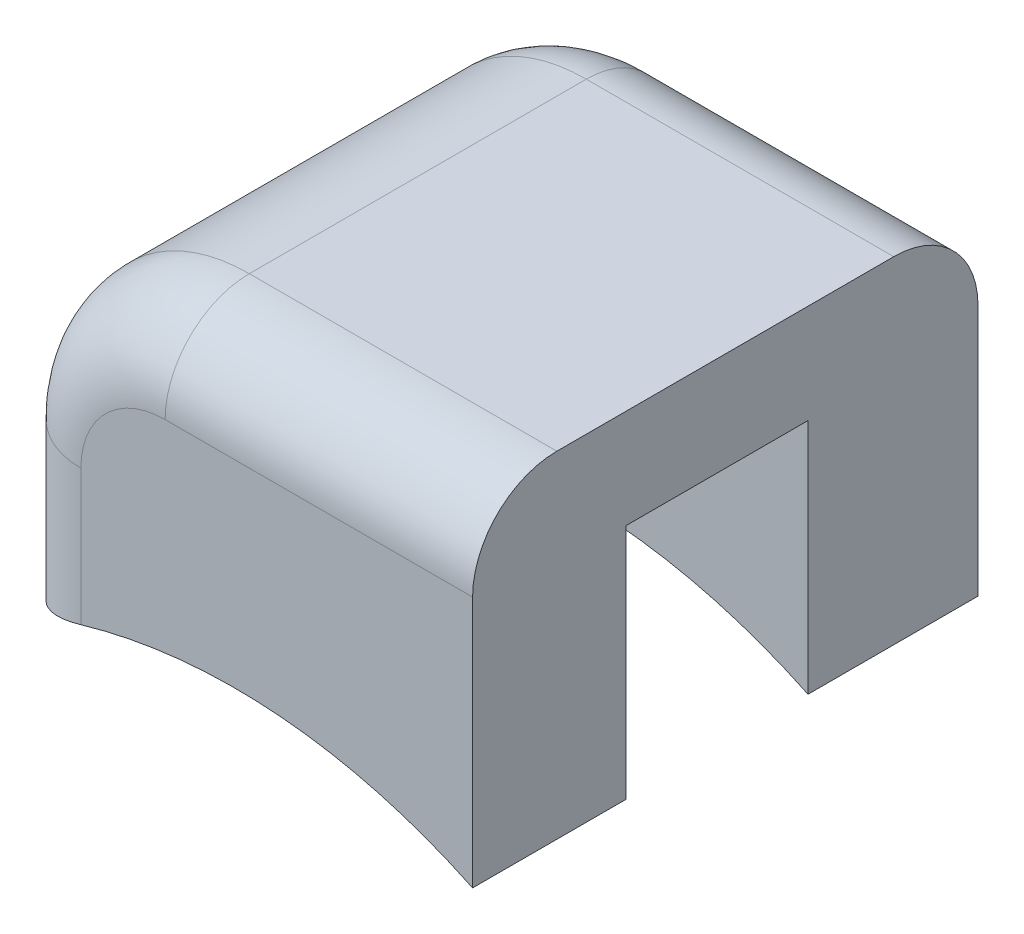
ISO-10303-21;
HEADER;
FILE_DESCRIPTION(('STEP AP214'),'2;1');
FILE_NAME('part.step','',(''),(''),'','','');
FILE_SCHEMA(('AUTOMOTIVE_DESIGN { 1 0 10303 214 1 1 1 1 }'));
ENDSEC;
DATA;
#1=APPLICATION_CONTEXT('core data for automotive mechanical design processes');
#2=APPLICATION_PROTOCOL_DEFINITION('international standard','automotive_design',2000,#1);
#3=PRODUCT_CONTEXT('',#1,'mechanical');
#4=PRODUCT('Part','Part','',(#3));
#5=PRODUCT_RELATED_PRODUCT_CATEGORY('part','',(#4));
#6=PRODUCT_DEFINITION_FORMATION('','',#4);
#7=PRODUCT_DEFINITION_CONTEXT('part definition',#1,'design');
#8=PRODUCT_DEFINITION('design','',#6,#7);
#9=PRODUCT_DEFINITION_SHAPE('','',#8);
#10=(LENGTH_UNIT() NAMED_UNIT(*) SI_UNIT(.MILLI.,.METRE.));
#11=(NAMED_UNIT(*) PLANE_ANGLE_UNIT() SI_UNIT($,.RADIAN.));
#12=(NAMED_UNIT(*) SI_UNIT($,.STERADIAN.) SOLID_ANGLE_UNIT());
#13=UNCERTAINTY_MEASURE_WITH_UNIT(LENGTH_MEASURE(1.E-05),#10,'distance_accuracy_value','');
#14=(GEOMETRIC_REPRESENTATION_CONTEXT(3) GLOBAL_UNCERTAINTY_ASSIGNED_CONTEXT((#13)) GLOBAL_UNIT_ASSIGNED_CONTEXT((#10,
#11,#12)) REPRESENTATION_CONTEXT('',''));
#15=CARTESIAN_POINT('',(0.,0.,0.));
#16=DIRECTION('',(0.,0.,1.));
#17=DIRECTION('',(1.,0.,0.));
#18=AXIS2_PLACEMENT_3D('',#15,#16,#17);
#19=CARTESIAN_POINT('',(-1.60474776372662,7.45402114965413,11.7834586810687));
#20=DIRECTION('',(0.,0.,-1.));
#21=DIRECTION('',(-0.266482277752373,-0.963839818457355,0.));
#22=AXIS2_PLACEMENT_3D('',#19,#20,#21);
#23=CYLINDRICAL_SURFACE('',#22,5.4);
#24=CARTESIAN_POINT('',(-1.60474776372662,7.45402114965413,11.7834586810687));
#25=DIRECTION('',(0.,0.,1.));
#26=DIRECTION('',(-0.266482277752373,-0.963839818457355,0.));
#27=AXIS2_PLACEMENT_3D('',#24,#25,#26);
#28=CIRCLE('',#27,5.4);
#29=CARTESIAN_POINT('',(-6.80948278339634,8.89302544951694,11.7834586810687));
#30=VERTEX_POINT('',#29);
#31=CARTESIAN_POINT('',(-7.00474776372663,7.45402114965413,11.7834586810687));
#32=VERTEX_POINT('',#31);
#33=EDGE_CURVE('E199',#30,#32,#28,.T.);
#34=ORIENTED_EDGE('',*,*,#33,.T.);
#35=DIRECTION('',(0.,0.,-1.));
#36=VECTOR('',#35,1.);
#37=CARTESIAN_POINT('',(-7.00474776372662,7.45402114965413,11.7834586810687));
#38=LINE('',#37,#36);
#39=CARTESIAN_POINT('',(-7.00474776372662,7.45402114965413,-9.81654131893127));
#40=VERTEX_POINT('',#39);
#41=EDGE_CURVE('E185',#40,#32,#38,.F.);
#42=ORIENTED_EDGE('',*,*,#41,.F.);
#43=CARTESIAN_POINT('',(-1.60474776372662,7.45402114965413,-9.81654131893128));
#44=DIRECTION('',(0.,0.,1.));
#45=DIRECTION('',(-0.266482277752373,-0.963839818457355,0.));
#46=AXIS2_PLACEMENT_3D('',#43,#44,#45);
#47=CIRCLE('',#46,5.4);
#48=CARTESIAN_POINT('',(-6.80948278339634,8.89302544951694,-9.81654131893128));
#49=VERTEX_POINT('',#48);
#50=EDGE_CURVE('E197',#49,#40,#47,.T.);
#51=ORIENTED_EDGE('',*,*,#50,.F.);
#52=DIRECTION('',(0.,0.,-1.));
#53=VECTOR('',#52,1.);
#54=CARTESIAN_POINT('',(-6.80948278339634,8.89302544951694,11.7834586810687));
#55=LINE('',#54,#53);
#56=EDGE_CURVE('E232',#30,#49,#55,.T.);
#57=ORIENTED_EDGE('',*,*,#56,.F.);
#58=EDGE_LOOP('',(#34,#42,#51,#57));
#59=FACE_BOUND('',#58,.T.);
#60=ADVANCED_FACE('F35',(#59),#23,.F.);
#61=CARTESIAN_POINT('',(8.21191709884672,-58.4631871224728,-30.));
#62=DIRECTION('',(0.,0.,1.));
#63=DIRECTION('',(1.,0.,0.));
#64=AXIS2_PLACEMENT_3D('',#61,#62,#63);
#65=CYLINDRICAL_SURFACE('',#64,65.);
#66=CARTESIAN_POINT('',(8.21191709884672,-58.4631871224728,-9.81654131893128));
#67=DIRECTION('',(0.,0.,-1.));
#68=DIRECTION('',(-1.,0.,0.));
#69=AXIS2_PLACEMENT_3D('',#66,#67,#68);
#70=CIRCLE('',#69,65.);
#71=CARTESIAN_POINT('',(36.4183536633174,0.097865944685166,-9.81654131893128));
#72=VERTEX_POINT('',#71);
#73=CARTESIAN_POINT('',(-7.00474776372662,4.73058717895761,-9.81654131893127));
#74=VERTEX_POINT('',#73);
#75=EDGE_CURVE('E247',#72,#74,#70,.F.);
#76=ORIENTED_EDGE('',*,*,#75,.T.);
#77=DIRECTION('',(0.,0.,1.));
#78=VECTOR('',#77,1.);
#79=CARTESIAN_POINT('',(-7.00474776372662,4.73058717895761,-30.));
#80=LINE('',#79,#78);
#81=CARTESIAN_POINT('',(-7.00474776372663,4.73058717895761,11.7834586810687));
#82=VERTEX_POINT('',#81);
#83=EDGE_CURVE('E188',#74,#82,#80,.T.);
#84=ORIENTED_EDGE('',*,*,#83,.T.);
#85=CARTESIAN_POINT('',(8.21191709884672,-58.4631871224728,11.7834586810687));
#86=DIRECTION('',(0.,0.,-1.));
#87=DIRECTION('',(-1.,0.,0.));
#88=AXIS2_PLACEMENT_3D('',#85,#86,#87);
#89=CIRCLE('',#88,65.);
#90=CARTESIAN_POINT('',(36.4183536633174,0.097865944685166,11.7834586810687));
#91=VERTEX_POINT('',#90);
#92=EDGE_CURVE('E251',#91,#82,#89,.F.);
#93=ORIENTED_EDGE('',*,*,#92,.F.);
#94=DIRECTION('',(0.,0.,1.));
#95=VECTOR('',#94,1.);
#96=CARTESIAN_POINT('',(36.4183536633174,0.097865944685166,-30.));
#97=LINE('',#96,#95);
#98=CARTESIAN_POINT('',(36.4183536633174,0.097865944685166,30.));
#99=VERTEX_POINT('',#98);
#100=EDGE_CURVE('E367',#91,#99,#97,.T.);
#101=ORIENTED_EDGE('',*,*,#100,.T.);
#102=CARTESIAN_POINT('',(8.21191709884672,-58.4631871224728,30.));
#103=DIRECTION('',(0.,0.,1.));
#104=DIRECTION('',(1.,0.,0.));
#105=AXIS2_PLACEMENT_3D('',#102,#103,#104);
#106=CIRCLE('',#105,65.);
#107=CARTESIAN_POINT('',(-10.0816463366826,3.90944739644315,30.));
#108=VERTEX_POINT('',#107);
#109=EDGE_CURVE('E243',#99,#108,#106,.T.);
#110=ORIENTED_EDGE('',*,*,#109,.T.);
#111=CARTESIAN_POINT('',(-10.0816463366826,3.90944739644316,30.));
#112=CARTESIAN_POINT('',(-10.378282537741,3.8224684695195,30.0000233975222));
#113=CARTESIAN_POINT('',(-10.6742547183916,3.73334122083876,29.9868027861182));
#114=CARTESIAN_POINT('',(-11.2627383926234,3.55158405455507,29.9343916264971));
#115=CARTESIAN_POINT('',(-11.5552506288941,3.45895490724183,29.8952067584868));
#116=CARTESIAN_POINT('',(-12.1345430642822,3.27103686715756,29.791433141585));
#117=CARTESIAN_POINT('',(-12.4213283548683,3.17575053552765,29.7268681193237));
#118=CARTESIAN_POINT('',(-12.9875438942233,2.98331169083991,29.5729737172092));
#119=CARTESIAN_POINT('',(-13.2669738209991,2.88615909640436,29.4836432551759));
#120=CARTESIAN_POINT('',(-13.81649185411,2.69099663953492,29.2809831904679));
#121=CARTESIAN_POINT('',(-14.0865848189868,2.59298725724344,29.1676662947932));
#122=CARTESIAN_POINT('',(-14.6159273850831,2.39705601588183,28.917734718645));
#123=CARTESIAN_POINT('',(-14.8751732222048,2.29913419854609,28.7811120328925));
#124=CARTESIAN_POINT('',(-15.3810418272217,2.10450846200494,28.4854139034765));
#125=CARTESIAN_POINT('',(-15.6276636525323,2.00780463414721,28.3263367865527));
#126=CARTESIAN_POINT('',(-16.1065919144859,1.81679788803389,27.9866279260235));
#127=CARTESIAN_POINT('',(-16.3388980791381,1.72249501541529,27.8059957730738));
#128=CARTESIAN_POINT('',(-16.789538169934,1.53670599086733,27.4224335299424));
#129=CARTESIAN_POINT('',(-17.0077274699484,1.44525284267398,27.2193173274404));
#130=CARTESIAN_POINT('',(-17.4260061521055,1.2674459423152,26.7933382077045));
#131=CARTESIAN_POINT('',(-17.6261025290174,1.18109022399221,26.5704829881558));
#132=CARTESIAN_POINT('',(-18.0065759297337,1.01482349623298,26.1061925786252));
#133=CARTESIAN_POINT('',(-18.1869487983716,0.934913845721202,25.8647534917506));
#134=CARTESIAN_POINT('',(-18.5261457692484,0.782998756154122,25.36485279095));
#135=CARTESIAN_POINT('',(-18.6849719369585,0.710992559598596,25.1063928121837));
#136=CARTESIAN_POINT('',(-18.9714197945042,0.57992988862597,24.5885415617894));
#137=CARTESIAN_POINT('',(-19.1002604686438,0.520385175025827,24.3299482792993));
#138=CARTESIAN_POINT('',(-19.3356721176254,0.410807110309911,23.8008961183374));
#139=CARTESIAN_POINT('',(-19.442246025665,0.360772506507275,23.5304388083988));
#140=CARTESIAN_POINT('',(-19.6316870307287,0.27134009555267,22.9801433895772));
#141=CARTESIAN_POINT('',(-19.7145932871243,0.231924724473483,22.7003216419988));
#142=CARTESIAN_POINT('',(-19.8558082937957,0.164527282034828,22.1333233466229));
#143=CARTESIAN_POINT('',(-19.9141298968374,0.136539236752666,21.8461507253409));
#144=CARTESIAN_POINT('',(-20.0002544374456,0.0951214082642211,21.2995574965327));
#145=CARTESIAN_POINT('',(-20.030755815797,0.0804065134463926,21.0406561609311));
#146=CARTESIAN_POINT('',(-20.0714603127351,0.0607452059903598,20.5211796437377));
#147=CARTESIAN_POINT('',(-20.0816853503566,0.055788244918784,20.2606065754688));
#148=CARTESIAN_POINT('',(-20.0816463366826,0.0558206281690486,20.));
#149=B_SPLINE_CURVE_WITH_KNOTS('',3,(#111,#112,#113,#114,#115,#116,#117,#118,#119,#120,#121,
#122,#123,#124,#125,#126,#127,#128,#129,#130,#131,#132,#133,#134,#135,#136,#137,#138,#139,#140,
#141,#142,#143,#144,#145,#146,#147,#148),.UNSPECIFIED.,.F.,.F.,(4,2,2,2,2,2,2,2,2,2,2,2,2,2,2,2,
2,2,4),(0.,0.927037950259322,1.85387315912949,2.77984396910066,3.70585524777369,
4.63137718701947,5.55721767523249,6.48312719172861,7.40905429465396,8.34331776001279,
9.27721847853309,10.2113155651059,11.1453230455694,12.0290877912175,12.9127360451638,
13.7949136688827,14.6766295196854,15.4589888449611,16.240501965779),.UNSPECIFIED.);
#150=CARTESIAN_POINT('',(-20.0816463366826,0.0558206281690427,20.));
#151=VERTEX_POINT('',#150);
#152=EDGE_CURVE('E281',#108,#151,#149,.T.);
#153=ORIENTED_EDGE('',*,*,#152,.T.);
#154=DIRECTION('',(0.,0.,1.));
#155=VECTOR('',#154,1.);
#156=CARTESIAN_POINT('',(-20.0816463366826,0.0558206281690427,-30.));
#157=LINE('',#156,#155);
#158=CARTESIAN_POINT('',(-20.0816463366826,0.0558206281690427,-20.));
#159=VERTEX_POINT('',#158);
#160=EDGE_CURVE('E364',#159,#151,#157,.T.);
#161=ORIENTED_EDGE('',*,*,#160,.F.);
#162=CARTESIAN_POINT('',(-20.0816463366826,0.0558206281690427,-20.));
#163=CARTESIAN_POINT('',(-20.0816898256157,0.055785374073303,-20.2632468680299));
#164=CARTESIAN_POINT('',(-20.0712535056147,0.0608451080586035,-20.5264748146823));
#165=CARTESIAN_POINT('',(-20.0297445247417,0.080894759068991,-21.0508346852526));
#166=CARTESIAN_POINT('',(-19.9986785753231,0.0958814465466083,-21.3119672629045));
#167=CARTESIAN_POINT('',(-19.9163933258543,0.135448539200208,-21.8292455362598));
#168=CARTESIAN_POINT('',(-19.8652527650541,0.159991458679941,-22.0854066609821));
#169=CARTESIAN_POINT('',(-19.743401678732,0.21819608625328,-22.591975685664));
#170=CARTESIAN_POINT('',(-19.6726902747543,0.251858203669251,-22.8423833268265));
#171=CARTESIAN_POINT('',(-19.5125329800728,0.327651358506734,-23.3354930895065));
#172=CARTESIAN_POINT('',(-19.4231077607029,0.369773049407864,-23.5782033757079));
#173=CARTESIAN_POINT('',(-19.226319085666,0.461807502674222,-24.0548067349629));
#174=CARTESIAN_POINT('',(-19.1189489022543,0.511723186621366,-24.2886964606416));
#175=CARTESIAN_POINT('',(-18.8872234005916,0.618560120416469,-24.7463268673653));
#176=CARTESIAN_POINT('',(-18.7628623768784,0.675483722860102,-24.9700641054798));
#177=CARTESIAN_POINT('',(-18.4981566171431,0.795509138838417,-25.4062432665296));
#178=CARTESIAN_POINT('',(-18.3578056637872,0.858613354221759,-25.6186807483833));
#179=CARTESIAN_POINT('',(-18.0549877018496,0.993338913319643,-26.041245511715));
#180=CARTESIAN_POINT('',(-17.8917757140655,1.06522560084971,-26.2507542767197));
#181=CARTESIAN_POINT('',(-17.5501064790644,1.21388435384116,-26.6552405437244));
#182=CARTESIAN_POINT('',(-17.3716426336388,1.29065853001038,-26.850211687509));
#183=CARTESIAN_POINT('',(-17.0007159096525,1.4481117033734,-27.2246754205517));
#184=CARTESIAN_POINT('',(-16.8082516207461,1.52879109368731,-27.4041664464165));
#185=CARTESIAN_POINT('',(-16.4105281044262,1.693121719101,-27.7468816308969));
#186=CARTESIAN_POINT('',(-16.205268096649,1.7767731353196,-27.9101047958151));
#187=CARTESIAN_POINT('',(-15.7644506347612,1.95365697073893,-28.2332789570941));
#188=CARTESIAN_POINT('',(-15.5278194589942,2.04708216918056,-28.3916622037097));
#189=CARTESIAN_POINT('',(-15.0424092858214,2.23528109337754,-28.6874385223039));
#190=CARTESIAN_POINT('',(-14.7936338419095,2.33005441897827,-28.8248376863571));
#191=CARTESIAN_POINT('',(-14.2853714917446,2.51997132632587,-29.0779572843017));
#192=CARTESIAN_POINT('',(-14.0258828856996,2.61511496464214,-29.1936742617568));
#193=CARTESIAN_POINT('',(-13.4979125242238,2.80476472531449,-29.4026425640901));
#194=CARTESIAN_POINT('',(-13.229434568863,2.89927109726144,-29.4959032486931));
#195=CARTESIAN_POINT('',(-12.7254599980836,3.07287036621806,-29.6472188130808));
#196=CARTESIAN_POINT('',(-12.4909805582677,3.15216961186091,-29.7084442396436));
#197=CARTESIAN_POINT('',(-12.017709157297,3.30917225014238,-29.8137873066604));
#198=CARTESIAN_POINT('',(-11.7789177682556,3.38687585161083,-29.8579071994887));
#199=CARTESIAN_POINT('',(-11.2981753947985,3.54019853407672,-29.9286985407761));
#200=CARTESIAN_POINT('',(-11.0562253392701,3.61581820842501,-29.9553750060639));
#201=CARTESIAN_POINT('',(-10.5702135165928,3.76459223964444,-29.9910332741437));
#202=CARTESIAN_POINT('',(-10.326151278723,3.83774602820823,-30.0000110249885));
#203=CARTESIAN_POINT('',(-10.0816463366826,3.90944739644315,-30.));
#204=B_SPLINE_CURVE_WITH_KNOTS('',3,(#162,#163,#164,#165,#166,#167,#168,#169,#170,#171,#172,
#173,#174,#175,#176,#177,#178,#179,#180,#181,#182,#183,#184,#185,#186,#187,#188,#189,#190,#191,
#192,#193,#194,#195,#196,#197,#198,#199,#200,#201,#202,#203),.UNSPECIFIED.,.F.,.F.,(4,2,2,2,2,2,
2,2,2,2,2,2,2,2,2,2,2,2,2,2,4),(0.,0.7894557995724,1.57865489062172,2.36478892618784,
3.15095825384602,3.9362637175971,4.72186426330649,5.50772926217347,6.29390087707607,
7.11843328532367,7.94332422347584,8.76829837303877,9.59332288404193,10.4913558613222,
11.389127625057,12.2870423843248,13.1845822447181,13.9489457457435,14.7132085648443,
15.4772514808254,16.2414692966394),.UNSPECIFIED.);
#205=CARTESIAN_POINT('',(-10.0816463366826,3.90944739644315,-30.));
#206=VERTEX_POINT('',#205);
#207=EDGE_CURVE('E273',#159,#206,#204,.T.);
#208=ORIENTED_EDGE('',*,*,#207,.T.);
#209=CARTESIAN_POINT('',(8.21191709884672,-58.4631871224728,-30.));
#210=DIRECTION('',(0.,0.,1.));
#211=DIRECTION('',(1.,0.,0.));
#212=AXIS2_PLACEMENT_3D('',#209,#210,#211);
#213=CIRCLE('',#212,65.);
#214=CARTESIAN_POINT('',(36.4183536633174,0.097865944685166,-30.));
#215=VERTEX_POINT('',#214);
#216=EDGE_CURVE('E244',#215,#206,#213,.T.);
#217=ORIENTED_EDGE('',*,*,#216,.F.);
#218=EDGE_CURVE('E399',#215,#72,#97,.T.);
#219=ORIENTED_EDGE('',*,*,#218,.T.);
#220=EDGE_LOOP('',(#76,#84,#93,#101,#110,#153,#161,#208,#217,#219));
#221=FACE_BOUND('',#220,.T.);
#222=ADVANCED_FACE('F291',(#221),#65,.F.);
#223=CARTESIAN_POINT('',(-22.5816463366826,40.,-30.));
#224=DIRECTION('',(0.,0.,1.));
#225=DIRECTION('',(1.,0.,0.));
#226=AXIS2_PLACEMENT_3D('',#223,#224,#225);
#227=PLANE('',#226);
#228=ORIENTED_EDGE('',*,*,#216,.T.);
#229=DIRECTION('',(0.,-1.,0.));
#230=VECTOR('',#229,1.);
#231=CARTESIAN_POINT('',(-10.0816463366826,20.,-30.));
#232=LINE('',#231,#230);
#233=CARTESIAN_POINT('',(-10.0816463366826,20.,-30.));
#234=VERTEX_POINT('',#233);
#235=EDGE_CURVE('E458',#206,#234,#232,.F.);
#236=ORIENTED_EDGE('',*,*,#235,.T.);
#237=CARTESIAN_POINT('',(-0.0816463366825846,20.,-30.));
#238=DIRECTION('',(0.,0.,1.));
#239=DIRECTION('',(1.,0.,0.));
#240=AXIS2_PLACEMENT_3D('',#237,#238,#239);
#241=CIRCLE('',#240,10.);
#242=CARTESIAN_POINT('',(-0.0816463366825846,30.,-30.));
#243=VERTEX_POINT('',#242);
#244=EDGE_CURVE('E472',#234,#243,#241,.F.);
#245=ORIENTED_EDGE('',*,*,#244,.T.);
#246=DIRECTION('',(-1.,0.,0.));
#247=VECTOR('',#246,1.);
#248=CARTESIAN_POINT('',(36.4183536633174,30.,-30.));
#249=LINE('',#248,#247);
#250=CARTESIAN_POINT('',(36.4183536633174,30.,-30.));
#251=VERTEX_POINT('',#250);
#252=EDGE_CURVE('E474',#243,#251,#249,.F.);
#253=ORIENTED_EDGE('',*,*,#252,.T.);
#254=DIRECTION('',(0.,1.,0.));
#255=VECTOR('',#254,1.);
#256=CARTESIAN_POINT('',(36.4183536633174,40.,-30.));
#257=LINE('',#256,#255);
#258=EDGE_CURVE('E408',#215,#251,#257,.T.);
#259=ORIENTED_EDGE('',*,*,#258,.F.);
#260=EDGE_LOOP('',(#228,#236,#245,#253,#259));
#261=FACE_BOUND('',#260,.T.);
#262=ADVANCED_FACE('F296',(#261),#227,.F.);
#263=CARTESIAN_POINT('',(-22.5816463366826,40.,30.));
#264=DIRECTION('',(0.,0.,-1.));
#265=DIRECTION('',(-1.,0.,0.));
#266=AXIS2_PLACEMENT_3D('',#263,#264,#265);
#267=PLANE('',#266);
#268=CARTESIAN_POINT('',(-0.08164633668258,20.,30.));
#269=DIRECTION('',(0.,0.,-1.));
#270=DIRECTION('',(-1.,0.,0.));
#271=AXIS2_PLACEMENT_3D('',#268,#269,#270);
#272=CIRCLE('',#271,10.);
#273=CARTESIAN_POINT('',(-0.08164633668258,30.,30.));
#274=VERTEX_POINT('',#273);
#275=CARTESIAN_POINT('',(-10.0816463366826,20.,30.));
#276=VERTEX_POINT('',#275);
#277=EDGE_CURVE('E269',#274,#276,#272,.F.);
#278=ORIENTED_EDGE('',*,*,#277,.T.);
#279=DIRECTION('',(0.,1.,0.));
#280=VECTOR('',#279,1.);
#281=CARTESIAN_POINT('',(-10.0816463366826,0.0558206281690427,30.));
#282=LINE('',#281,#280);
#283=EDGE_CURVE('E271',#276,#108,#282,.F.);
#284=ORIENTED_EDGE('',*,*,#283,.T.);
#285=ORIENTED_EDGE('',*,*,#109,.F.);
#286=DIRECTION('',(0.,-1.,0.));
#287=VECTOR('',#286,1.);
#288=CARTESIAN_POINT('',(36.4183536633174,40.,30.));
#289=LINE('',#288,#287);
#290=CARTESIAN_POINT('',(36.4183536633174,30.,30.));
#291=VERTEX_POINT('',#290);
#292=EDGE_CURVE('E404',#291,#99,#289,.T.);
#293=ORIENTED_EDGE('',*,*,#292,.F.);
#294=DIRECTION('',(1.,0.,0.));
#295=VECTOR('',#294,1.);
#296=CARTESIAN_POINT('',(-0.0816463366825788,30.,30.));
#297=LINE('',#296,#295);
#298=EDGE_CURVE('E267',#291,#274,#297,.F.);
#299=ORIENTED_EDGE('',*,*,#298,.T.);
#300=EDGE_LOOP('',(#278,#284,#285,#293,#299));
#301=FACE_BOUND('',#300,.T.);
#302=ADVANCED_FACE('F305',(#301),#267,.F.);
#303=CARTESIAN_POINT('',(0.,40.,0.));
#304=DIRECTION('',(0.,1.,0.));
#305=DIRECTION('',(0.,0.,1.));
#306=AXIS2_PLACEMENT_3D('',#303,#304,#305);
#307=PLANE('',#306);
#308=DIRECTION('',(0.,0.,-1.));
#309=VECTOR('',#308,1.);
#310=CARTESIAN_POINT('',(-0.0816463366825823,40.,0.));
#311=LINE('',#310,#309);
#312=CARTESIAN_POINT('',(-0.0816463366825846,40.,-20.));
#313=VERTEX_POINT('',#312);
#314=CARTESIAN_POINT('',(-0.08164633668258,40.,20.));
#315=VERTEX_POINT('',#314);
#316=EDGE_CURVE('E259',#313,#315,#311,.F.);
#317=ORIENTED_EDGE('',*,*,#316,.T.);
#318=DIRECTION('',(1.,0.,0.));
#319=VECTOR('',#318,1.);
#320=CARTESIAN_POINT('',(36.4183536633174,40.,20.));
#321=LINE('',#320,#319);
#322=CARTESIAN_POINT('',(36.4183536633174,40.,20.));
#323=VERTEX_POINT('',#322);
#324=EDGE_CURVE('E52',#315,#323,#321,.T.);
#325=ORIENTED_EDGE('',*,*,#324,.T.);
#326=DIRECTION('',(0.,0.,1.));
#327=VECTOR('',#326,1.);
#328=CARTESIAN_POINT('',(36.4183536633174,40.,-30.));
#329=LINE('',#328,#327);
#330=CARTESIAN_POINT('',(36.4183536633174,40.,-20.));
#331=VERTEX_POINT('',#330);
#332=EDGE_CURVE('E406',#331,#323,#329,.T.);
#333=ORIENTED_EDGE('',*,*,#332,.F.);
#334=DIRECTION('',(-1.,0.,0.));
#335=VECTOR('',#334,1.);
#336=CARTESIAN_POINT('',(-0.0816463366825858,40.,-20.));
#337=LINE('',#336,#335);
#338=EDGE_CURVE('E469',#331,#313,#337,.T.);
#339=ORIENTED_EDGE('',*,*,#338,.T.);
#340=EDGE_LOOP('',(#317,#325,#333,#339));
#341=FACE_BOUND('',#340,.T.);
#342=ADVANCED_FACE('F300',(#341),#307,.T.);
#343=CARTESIAN_POINT('',(19.9002720440897,25.583077507882,11.7834586810687));
#344=DIRECTION('',(0.158826238945833,-0.987306551088527,0.));
#345=DIRECTION('',(0.987306551088527,0.158826238945833,0.));
#346=AXIS2_PLACEMENT_3D('',#343,#344,#345);
#347=PLANE('',#346);
#348=DIRECTION('',(0.,0.,-1.));
#349=VECTOR('',#348,1.);
#350=CARTESIAN_POINT('',(36.4183536633174,28.2403117532031,11.7834586810687));
#351=LINE('',#350,#349);
#352=CARTESIAN_POINT('',(36.4183536633174,28.2403117532031,11.7834586810687));
#353=VERTEX_POINT('',#352);
#354=CARTESIAN_POINT('',(36.4183536633174,28.2403117532031,-9.81654131893128));
#355=VERTEX_POINT('',#354);
#356=EDGE_CURVE('E402',#353,#355,#351,.T.);
#357=ORIENTED_EDGE('',*,*,#356,.F.);
#358=DIRECTION('',(-0.987306551088527,-0.158826238945833,0.));
#359=VECTOR('',#358,1.);
#360=CARTESIAN_POINT('',(19.9002720440897,25.583077507882,11.7834586810687));
#361=LINE('',#360,#359);
#362=CARTESIAN_POINT('',(19.9002720440897,25.583077507882,11.7834586810687));
#363=VERTEX_POINT('',#362);
#364=EDGE_CURVE('E378',#353,#363,#361,.T.);
#365=ORIENTED_EDGE('',*,*,#364,.T.);
#366=DIRECTION('',(0.,0.,-1.));
#367=VECTOR('',#366,1.);
#368=CARTESIAN_POINT('',(19.9002720440897,25.583077507882,11.7834586810687));
#369=LINE('',#368,#367);
#370=CARTESIAN_POINT('',(19.9002720440897,25.583077507882,-9.81654131893128));
#371=VERTEX_POINT('',#370);
#372=EDGE_CURVE('E229',#363,#371,#369,.T.);
#373=ORIENTED_EDGE('',*,*,#372,.T.);
#374=DIRECTION('',(-0.987306551088527,-0.158826238945833,0.));
#375=VECTOR('',#374,1.);
#376=CARTESIAN_POINT('',(19.9002720440897,25.583077507882,-9.81654131893128));
#377=LINE('',#376,#375);
#378=EDGE_CURVE('E205',#355,#371,#377,.T.);
#379=ORIENTED_EDGE('',*,*,#378,.F.);
#380=EDGE_LOOP('',(#357,#365,#373,#379));
#381=FACE_BOUND('',#380,.T.);
#382=ADVANCED_FACE('F304',(#381),#347,.T.);
#383=CARTESIAN_POINT('',(1.2892954496052,17.9214867870408,11.7834586810687));
#384=DIRECTION('',(0.,0.,-1.));
#385=DIRECTION('',(-0.266482277752373,-0.963839818457355,0.));
#386=AXIS2_PLACEMENT_3D('',#383,#384,#385);
#387=PLANE('',#386);
#388=ORIENTED_EDGE('',*,*,#92,.T.);
#389=DIRECTION('',(0.,-1.,0.));
#390=VECTOR('',#389,1.);
#391=CARTESIAN_POINT('',(-7.00474776372663,40.001,11.7834586810687));
#392=LINE('',#391,#390);
#393=EDGE_CURVE('E192',#32,#82,#392,.T.);
#394=ORIENTED_EDGE('',*,*,#393,.F.);
#395=ORIENTED_EDGE('',*,*,#33,.F.);
#396=DIRECTION('',(-0.266482277752373,-0.963839818457355,0.));
#397=VECTOR('',#396,1.);
#398=CARTESIAN_POINT('',(-6.80948278339634,8.89302544951694,11.7834586810687));
#399=LINE('',#398,#397);
#400=CARTESIAN_POINT('',(-3.91543957006451,19.3604910869036,11.7834586810687));
#401=VERTEX_POINT('',#400);
#402=EDGE_CURVE('E375',#401,#30,#399,.T.);
#403=ORIENTED_EDGE('',*,*,#402,.F.);
#404=CARTESIAN_POINT('',(1.2892954496052,17.9214867870408,11.7834586810687));
#405=DIRECTION('',(0.,0.,1.));
#406=DIRECTION('',(-0.266482277752373,-0.963839818457355,0.));
#407=AXIS2_PLACEMENT_3D('',#404,#405,#406);
#408=CIRCLE('',#407,5.40000000000001);
#409=CARTESIAN_POINT('',(0.25454220475646,23.2214194019214,11.7834586810687));
#410=VERTEX_POINT('',#409);
#411=EDGE_CURVE('E373',#410,#401,#408,.T.);
#412=ORIENTED_EDGE('',*,*,#411,.F.);
#413=DIRECTION('',(-0.981469002755665,-0.191620971268284,0.));
#414=VECTOR('',#413,1.);
#415=CARTESIAN_POINT('',(0.25454220475646,23.2214194019214,11.7834586810687));
#416=LINE('',#415,#414);
#417=CARTESIAN_POINT('',(6.40567059029893,24.4223592098258,11.7834586810687));
#418=VERTEX_POINT('',#417);
#419=EDGE_CURVE('E393',#418,#410,#416,.T.);
#420=ORIENTED_EDGE('',*,*,#419,.F.);
#421=DIRECTION('',(-0.266482277752373,-0.963839818457355,0.));
#422=VECTOR('',#421,1.);
#423=CARTESIAN_POINT('',(8.30637604526595,31.2970212553022,11.7834586810687));
#424=LINE('',#423,#422);
#425=CARTESIAN_POINT('',(8.30637604526595,31.2970212553022,11.7834586810687));
#426=VERTEX_POINT('',#425);
#427=EDGE_CURVE('E218',#426,#418,#424,.T.);
#428=ORIENTED_EDGE('',*,*,#427,.F.);
#429=DIRECTION('',(-0.963839818457354,0.266482277752375,0.));
#430=VECTOR('',#429,1.);
#431=CARTESIAN_POINT('',(11.0469553986834,30.5393063171201,11.7834586810687));
#432=LINE('',#431,#430);
#433=CARTESIAN_POINT('',(11.0469553986834,30.5393063171201,11.7834586810687));
#434=VERTEX_POINT('',#433);
#435=EDGE_CURVE('E223',#434,#426,#432,.T.);
#436=ORIENTED_EDGE('',*,*,#435,.F.);
#437=DIRECTION('',(0.266482277752373,0.963839818457355,0.));
#438=VECTOR('',#437,1.);
#439=CARTESIAN_POINT('',(10.4026655558105,28.2089742198929,11.7834586810687));
#440=LINE('',#439,#438);
#441=CARTESIAN_POINT('',(10.4026655558105,28.2089742198929,11.7834586810687));
#442=VERTEX_POINT('',#441);
#443=EDGE_CURVE('E385',#442,#434,#440,.T.);
#444=ORIENTED_EDGE('',*,*,#443,.F.);
#445=DIRECTION('',(-0.963839818457355,0.266482277752373,0.));
#446=VECTOR('',#445,1.);
#447=CARTESIAN_POINT('',(19.9002720440897,25.583077507882,11.7834586810687));
#448=LINE('',#447,#446);
#449=EDGE_CURVE('E380',#363,#442,#448,.T.);
#450=ORIENTED_EDGE('',*,*,#449,.F.);
#451=ORIENTED_EDGE('',*,*,#364,.F.);
#452=DIRECTION('',(0.,1.,0.));
#453=VECTOR('',#452,1.);
#454=CARTESIAN_POINT('',(36.4183536633174,17.9214867870408,11.7834586810687));
#455=LINE('',#454,#453);
#456=EDGE_CURVE('E397',#91,#353,#455,.T.);
#457=ORIENTED_EDGE('',*,*,#456,.F.);
#458=EDGE_LOOP('',(#388,#394,#395,#403,#412,#420,#428,#436,#444,#450,#451,#457));
#459=FACE_BOUND('',#458,.T.);
#460=ADVANCED_FACE('F377',(#459),#387,.T.);
#461=CARTESIAN_POINT('',(1.2892954496052,17.9214867870408,-9.81654131893128));
#462=DIRECTION('',(0.,0.,-1.));
#463=DIRECTION('',(-0.266482277752373,-0.963839818457355,0.));
#464=AXIS2_PLACEMENT_3D('',#461,#462,#463);
#465=PLANE('',#464);
#466=DIRECTION('',(0.,-1.,0.));
#467=VECTOR('',#466,1.);
#468=CARTESIAN_POINT('',(-7.00474776372662,40.001,-9.81654131893127));
#469=LINE('',#468,#467);
#470=EDGE_CURVE('E181',#40,#74,#469,.T.);
#471=ORIENTED_EDGE('',*,*,#470,.T.);
#472=ORIENTED_EDGE('',*,*,#75,.F.);
#473=DIRECTION('',(0.,1.,0.));
#474=VECTOR('',#473,1.);
#475=CARTESIAN_POINT('',(36.4183536633174,17.9214867870408,-9.81654131893128));
#476=LINE('',#475,#474);
#477=EDGE_CURVE('E253',#72,#355,#476,.T.);
#478=ORIENTED_EDGE('',*,*,#477,.T.);
#479=ORIENTED_EDGE('',*,*,#378,.T.);
#480=DIRECTION('',(-0.963839818457355,0.266482277752373,0.));
#481=VECTOR('',#480,1.);
#482=CARTESIAN_POINT('',(19.9002720440897,25.583077507882,-9.81654131893128));
#483=LINE('',#482,#481);
#484=CARTESIAN_POINT('',(10.4026655558105,28.2089742198929,-9.81654131893128));
#485=VERTEX_POINT('',#484);
#486=EDGE_CURVE('E207',#371,#485,#483,.T.);
#487=ORIENTED_EDGE('',*,*,#486,.T.);
#488=DIRECTION('',(0.266482277752373,0.963839818457355,0.));
#489=VECTOR('',#488,1.);
#490=CARTESIAN_POINT('',(10.4026655558105,28.2089742198929,-9.81654131893128));
#491=LINE('',#490,#489);
#492=CARTESIAN_POINT('',(11.0469553986834,30.5393063171201,-9.81654131893128));
#493=VERTEX_POINT('',#492);
#494=EDGE_CURVE('E214',#485,#493,#491,.T.);
#495=ORIENTED_EDGE('',*,*,#494,.T.);
#496=DIRECTION('',(-0.963839818457354,0.266482277752375,0.));
#497=VECTOR('',#496,1.);
#498=CARTESIAN_POINT('',(11.0469553986834,30.5393063171201,-9.81654131893128));
#499=LINE('',#498,#497);
#500=CARTESIAN_POINT('',(8.30637604526595,31.2970212553022,-9.81654131893128));
#501=VERTEX_POINT('',#500);
#502=EDGE_CURVE('E216',#493,#501,#499,.T.);
#503=ORIENTED_EDGE('',*,*,#502,.T.);
#504=DIRECTION('',(-0.266482277752373,-0.963839818457355,0.));
#505=VECTOR('',#504,1.);
#506=CARTESIAN_POINT('',(8.30637604526595,31.2970212553022,-9.81654131893128));
#507=LINE('',#506,#505);
#508=CARTESIAN_POINT('',(6.40567059029893,24.4223592098258,-9.81654131893128));
#509=VERTEX_POINT('',#508);
#510=EDGE_CURVE('E357',#501,#509,#507,.T.);
#511=ORIENTED_EDGE('',*,*,#510,.T.);
#512=DIRECTION('',(-0.981469002755665,-0.191620971268284,0.));
#513=VECTOR('',#512,1.);
#514=CARTESIAN_POINT('',(0.25454220475646,23.2214194019214,-9.81654131893128));
#515=LINE('',#514,#513);
#516=CARTESIAN_POINT('',(0.25454220475646,23.2214194019214,-9.81654131893128));
#517=VERTEX_POINT('',#516);
#518=EDGE_CURVE('E353',#509,#517,#515,.T.);
#519=ORIENTED_EDGE('',*,*,#518,.T.);
#520=CARTESIAN_POINT('',(1.2892954496052,17.9214867870408,-9.81654131893128));
#521=DIRECTION('',(0.,0.,1.));
#522=DIRECTION('',(-0.266482277752373,-0.963839818457355,0.));
#523=AXIS2_PLACEMENT_3D('',#520,#521,#522);
#524=CIRCLE('',#523,5.40000000000001);
#525=CARTESIAN_POINT('',(-3.91543957006451,19.3604910869036,-9.81654131893128));
#526=VERTEX_POINT('',#525);
#527=EDGE_CURVE('E209',#517,#526,#524,.T.);
#528=ORIENTED_EDGE('',*,*,#527,.T.);
#529=DIRECTION('',(-0.266482277752373,-0.963839818457355,0.));
#530=VECTOR('',#529,1.);
#531=CARTESIAN_POINT('',(-6.80948278339634,8.89302544951694,-9.81654131893128));
#532=LINE('',#531,#530);
#533=EDGE_CURVE('E203',#526,#49,#532,.T.);
#534=ORIENTED_EDGE('',*,*,#533,.T.);
#535=ORIENTED_EDGE('',*,*,#50,.T.);
#536=EDGE_LOOP('',(#471,#472,#478,#479,#487,#495,#503,#511,#519,#528,#534,#535));
#537=FACE_BOUND('',#536,.T.);
#538=ADVANCED_FACE('F201',(#537),#465,.F.);
#539=CARTESIAN_POINT('',(8.30637604526595,31.2970212553022,11.7834586810687));
#540=DIRECTION('',(0.963839818457355,-0.266482277752373,0.));
#541=DIRECTION('',(0.,0.,-1.));
#542=AXIS2_PLACEMENT_3D('',#539,#540,#541);
#543=PLANE('',#542);
#544=ORIENTED_EDGE('',*,*,#510,.F.);
#545=DIRECTION('',(0.,0.,-1.));
#546=VECTOR('',#545,1.);
#547=CARTESIAN_POINT('',(8.30637604526595,31.2970212553022,11.7834586810687));
#548=LINE('',#547,#546);
#549=EDGE_CURVE('E219',#426,#501,#548,.T.);
#550=ORIENTED_EDGE('',*,*,#549,.F.);
#551=ORIENTED_EDGE('',*,*,#427,.T.);
#552=DIRECTION('',(0.,0.,-1.));
#553=VECTOR('',#552,1.);
#554=CARTESIAN_POINT('',(6.40567059029893,24.4223592098258,11.7834586810687));
#555=LINE('',#554,#553);
#556=EDGE_CURVE('E240',#418,#509,#555,.T.);
#557=ORIENTED_EDGE('',*,*,#556,.T.);
#558=EDGE_LOOP('',(#544,#550,#551,#557));
#559=FACE_BOUND('',#558,.T.);
#560=ADVANCED_FACE('F298',(#559),#543,.T.);
#561=CARTESIAN_POINT('',(0.25454220475646,23.2214194019214,11.7834586810687));
#562=DIRECTION('',(0.191620971268284,-0.981469002755665,0.));
#563=DIRECTION('',(0.981469002755665,0.191620971268284,0.));
#564=AXIS2_PLACEMENT_3D('',#561,#562,#563);
#565=PLANE('',#564);
#566=ORIENTED_EDGE('',*,*,#518,.F.);
#567=ORIENTED_EDGE('',*,*,#556,.F.);
#568=ORIENTED_EDGE('',*,*,#419,.T.);
#569=DIRECTION('',(0.,0.,-1.));
#570=VECTOR('',#569,1.);
#571=CARTESIAN_POINT('',(0.25454220475646,23.2214194019214,11.7834586810687));
#572=LINE('',#571,#570);
#573=EDGE_CURVE('E237',#410,#517,#572,.T.);
#574=ORIENTED_EDGE('',*,*,#573,.T.);
#575=EDGE_LOOP('',(#566,#567,#568,#574));
#576=FACE_BOUND('',#575,.T.);
#577=ADVANCED_FACE('F344',(#576),#565,.T.);
#578=CARTESIAN_POINT('',(1.2892954496052,17.9214867870408,11.7834586810687));
#579=DIRECTION('',(0.,0.,-1.));
#580=DIRECTION('',(-0.266482277752373,-0.963839818457355,0.));
#581=AXIS2_PLACEMENT_3D('',#578,#579,#580);
#582=CYLINDRICAL_SURFACE('',#581,5.40000000000001);
#583=ORIENTED_EDGE('',*,*,#527,.F.);
#584=ORIENTED_EDGE('',*,*,#573,.F.);
#585=ORIENTED_EDGE('',*,*,#411,.T.);
#586=DIRECTION('',(0.,0.,-1.));
#587=VECTOR('',#586,1.);
#588=CARTESIAN_POINT('',(-3.91543957006451,19.3604910869036,11.7834586810687));
#589=LINE('',#588,#587);
#590=EDGE_CURVE('E234',#401,#526,#589,.T.);
#591=ORIENTED_EDGE('',*,*,#590,.T.);
#592=EDGE_LOOP('',(#583,#584,#585,#591));
#593=FACE_BOUND('',#592,.T.);
#594=ADVANCED_FACE('F341',(#593),#582,.F.);
#595=CARTESIAN_POINT('',(-6.80948278339634,8.89302544951694,11.7834586810687));
#596=DIRECTION('',(0.963839818457355,-0.266482277752373,0.));
#597=DIRECTION('',(0.,0.,-1.));
#598=AXIS2_PLACEMENT_3D('',#595,#596,#597);
#599=PLANE('',#598);
#600=ORIENTED_EDGE('',*,*,#533,.F.);
#601=ORIENTED_EDGE('',*,*,#590,.F.);
#602=ORIENTED_EDGE('',*,*,#402,.T.);
#603=ORIENTED_EDGE('',*,*,#56,.T.);
#604=EDGE_LOOP('',(#600,#601,#602,#603));
#605=FACE_BOUND('',#604,.T.);
#606=ADVANCED_FACE('F337',(#605),#599,.T.);
#607=CARTESIAN_POINT('',(19.9002720440897,25.583077507882,11.7834586810687));
#608=DIRECTION('',(-0.266482277752373,-0.963839818457355,0.));
#609=DIRECTION('',(0.,0.,1.));
#610=AXIS2_PLACEMENT_3D('',#607,#608,#609);
#611=PLANE('',#610);
#612=ORIENTED_EDGE('',*,*,#486,.F.);
#613=ORIENTED_EDGE('',*,*,#372,.F.);
#614=ORIENTED_EDGE('',*,*,#449,.T.);
#615=DIRECTION('',(0.,0.,-1.));
#616=VECTOR('',#615,1.);
#617=CARTESIAN_POINT('',(10.4026655558105,28.2089742198929,11.7834586810687));
#618=LINE('',#617,#616);
#619=EDGE_CURVE('E226',#442,#485,#618,.T.);
#620=ORIENTED_EDGE('',*,*,#619,.T.);
#621=EDGE_LOOP('',(#612,#613,#614,#620));
#622=FACE_BOUND('',#621,.T.);
#623=ADVANCED_FACE('F340',(#622),#611,.T.);
#624=CARTESIAN_POINT('',(10.4026655558105,28.2089742198929,11.7834586810687));
#625=DIRECTION('',(-0.963839818457355,0.266482277752373,0.));
#626=DIRECTION('',(0.,0.,1.));
#627=AXIS2_PLACEMENT_3D('',#624,#625,#626);
#628=PLANE('',#627);
#629=ORIENTED_EDGE('',*,*,#494,.F.);
#630=ORIENTED_EDGE('',*,*,#619,.F.);
#631=ORIENTED_EDGE('',*,*,#443,.T.);
#632=DIRECTION('',(0.,0.,-1.));
#633=VECTOR('',#632,1.);
#634=CARTESIAN_POINT('',(11.0469553986834,30.5393063171201,11.7834586810687));
#635=LINE('',#634,#633);
#636=EDGE_CURVE('E222',#434,#493,#635,.T.);
#637=ORIENTED_EDGE('',*,*,#636,.T.);
#638=EDGE_LOOP('',(#629,#630,#631,#637));
#639=FACE_BOUND('',#638,.T.);
#640=ADVANCED_FACE('F425',(#639),#628,.T.);
#641=CARTESIAN_POINT('',(11.0469553986834,30.5393063171201,11.7834586810687));
#642=DIRECTION('',(-0.266482277752375,-0.963839818457354,0.));
#643=DIRECTION('',(0.963839818457354,-0.266482277752375,0.));
#644=AXIS2_PLACEMENT_3D('',#641,#642,#643);
#645=PLANE('',#644);
#646=ORIENTED_EDGE('',*,*,#502,.F.);
#647=ORIENTED_EDGE('',*,*,#636,.F.);
#648=ORIENTED_EDGE('',*,*,#435,.T.);
#649=ORIENTED_EDGE('',*,*,#549,.T.);
#650=EDGE_LOOP('',(#646,#647,#648,#649));
#651=FACE_BOUND('',#650,.T.);
#652=ADVANCED_FACE('F392',(#651),#645,.T.);
#653=CARTESIAN_POINT('',(-20.0816463366826,0.,0.));
#654=DIRECTION('',(-1.,0.,0.));
#655=DIRECTION('',(0.,0.,1.));
#656=AXIS2_PLACEMENT_3D('',#653,#654,#655);
#657=PLANE('',#656);
#658=ORIENTED_EDGE('',*,*,#160,.T.);
#659=DIRECTION('',(0.,1.,0.));
#660=VECTOR('',#659,1.);
#661=CARTESIAN_POINT('',(-20.0816463366826,20.,20.));
#662=LINE('',#661,#660);
#663=CARTESIAN_POINT('',(-20.0816463366826,20.,20.));
#664=VERTEX_POINT('',#663);
#665=EDGE_CURVE('E264',#151,#664,#662,.T.);
#666=ORIENTED_EDGE('',*,*,#665,.T.);
#667=DIRECTION('',(0.,0.,-1.));
#668=VECTOR('',#667,1.);
#669=CARTESIAN_POINT('',(-20.0816463366826,20.,0.));
#670=LINE('',#669,#668);
#671=CARTESIAN_POINT('',(-20.0816463366826,20.,-20.));
#672=VERTEX_POINT('',#671);
#673=EDGE_CURVE('E256',#664,#672,#670,.T.);
#674=ORIENTED_EDGE('',*,*,#673,.T.);
#675=DIRECTION('',(0.,-1.,0.));
#676=VECTOR('',#675,1.);
#677=CARTESIAN_POINT('',(-20.0816463366826,0.0558206281690427,-20.));
#678=LINE('',#677,#676);
#679=EDGE_CURVE('E261',#672,#159,#678,.T.);
#680=ORIENTED_EDGE('',*,*,#679,.T.);
#681=EDGE_LOOP('',(#658,#666,#674,#680));
#682=FACE_BOUND('',#681,.T.);
#683=ADVANCED_FACE('F432',(#682),#657,.T.);
#684=CARTESIAN_POINT('',(36.4183536633174,0.,0.));
#685=DIRECTION('',(-1.,0.,0.));
#686=DIRECTION('',(0.,0.,1.));
#687=AXIS2_PLACEMENT_3D('',#684,#685,#686);
#688=PLANE('',#687);
#689=ORIENTED_EDGE('',*,*,#332,.T.);
#690=CARTESIAN_POINT('',(36.4183536633174,30.,20.));
#691=DIRECTION('',(-1.,0.,0.));
#692=DIRECTION('',(0.,0.,1.));
#693=AXIS2_PLACEMENT_3D('',#690,#691,#692);
#694=CIRCLE('',#693,10.);
#695=EDGE_CURVE('E11',#323,#291,#694,.F.);
#696=ORIENTED_EDGE('',*,*,#695,.T.);
#697=ORIENTED_EDGE('',*,*,#292,.T.);
#698=ORIENTED_EDGE('',*,*,#100,.F.);
#699=ORIENTED_EDGE('',*,*,#456,.T.);
#700=ORIENTED_EDGE('',*,*,#356,.T.);
#701=ORIENTED_EDGE('',*,*,#477,.F.);
#702=ORIENTED_EDGE('',*,*,#218,.F.);
#703=ORIENTED_EDGE('',*,*,#258,.T.);
#704=CARTESIAN_POINT('',(36.4183536633174,30.,-20.));
#705=DIRECTION('',(-1.,0.,0.));
#706=DIRECTION('',(0.,0.,1.));
#707=AXIS2_PLACEMENT_3D('',#704,#705,#706);
#708=CIRCLE('',#707,10.);
#709=EDGE_CURVE('E44',#251,#331,#708,.F.);
#710=ORIENTED_EDGE('',*,*,#709,.T.);
#711=EDGE_LOOP('',(#689,#696,#697,#698,#699,#700,#701,#702,#703,#710));
#712=FACE_BOUND('',#711,.T.);
#713=ADVANCED_FACE('F315',(#712),#688,.F.);
#714=CARTESIAN_POINT('',(-0.0816463366825823,20.,0.));
#715=DIRECTION('',(0.,0.,-1.));
#716=DIRECTION('',(-1.,0.,0.));
#717=AXIS2_PLACEMENT_3D('',#714,#715,#716);
#718=CYLINDRICAL_SURFACE('',#717,20.);
#719=ORIENTED_EDGE('',*,*,#673,.F.);
#720=CARTESIAN_POINT('',(-0.08164633668258,20.,20.));
#721=DIRECTION('',(0.,0.,-1.));
#722=DIRECTION('',(-1.,0.,0.));
#723=AXIS2_PLACEMENT_3D('',#720,#721,#722);
#724=CIRCLE('',#723,20.);
#725=EDGE_CURVE('E476',#664,#315,#724,.T.);
#726=ORIENTED_EDGE('',*,*,#725,.T.);
#727=ORIENTED_EDGE('',*,*,#316,.F.);
#728=CARTESIAN_POINT('',(-0.0816463366825846,20.,-20.));
#729=DIRECTION('',(0.,0.,1.));
#730=DIRECTION('',(1.,0.,0.));
#731=AXIS2_PLACEMENT_3D('',#728,#729,#730);
#732=CIRCLE('',#731,20.);
#733=EDGE_CURVE('E477',#313,#672,#732,.T.);
#734=ORIENTED_EDGE('',*,*,#733,.T.);
#735=EDGE_LOOP('',(#719,#726,#727,#734));
#736=FACE_BOUND('',#735,.T.);
#737=ADVANCED_FACE('F312',(#736),#718,.T.);
#738=CARTESIAN_POINT('',(0.,30.,20.));
#739=DIRECTION('',(-1.,0.,0.));
#740=DIRECTION('',(0.,0.,1.));
#741=AXIS2_PLACEMENT_3D('',#738,#739,#740);
#742=CYLINDRICAL_SURFACE('',#741,10.);
#743=ORIENTED_EDGE('',*,*,#695,.F.);
#744=ORIENTED_EDGE('',*,*,#324,.F.);
#745=CARTESIAN_POINT('',(-0.08164633668258,30.,20.));
#746=DIRECTION('',(-1.,0.,0.));
#747=DIRECTION('',(0.,0.,1.));
#748=AXIS2_PLACEMENT_3D('',#745,#746,#747);
#749=CIRCLE('',#748,10.);
#750=EDGE_CURVE('E410',#274,#315,#749,.T.);
#751=ORIENTED_EDGE('',*,*,#750,.F.);
#752=ORIENTED_EDGE('',*,*,#298,.F.);
#753=EDGE_LOOP('',(#743,#744,#751,#752));
#754=FACE_BOUND('',#753,.T.);
#755=ADVANCED_FACE('F314',(#754),#742,.T.);
#756=CARTESIAN_POINT('',(-0.08164633668258,20.,20.));
#757=DIRECTION('',(0.,0.,-1.));
#758=DIRECTION('',(-1.,0.,0.));
#759=AXIS2_PLACEMENT_3D('',#756,#757,#758);
#760=DEGENERATE_TOROIDAL_SURFACE('',#759,10.,10.,.T.);
#761=ORIENTED_EDGE('',*,*,#750,.T.);
#762=ORIENTED_EDGE('',*,*,#725,.F.);
#763=CARTESIAN_POINT('',(-10.0816463366826,20.,20.));
#764=DIRECTION('',(0.,-1.,0.));
#765=DIRECTION('',(0.,0.,-1.));
#766=AXIS2_PLACEMENT_3D('',#763,#764,#765);
#767=CIRCLE('',#766,10.);
#768=EDGE_CURVE('E462',#276,#664,#767,.T.);
#769=ORIENTED_EDGE('',*,*,#768,.F.);
#770=ORIENTED_EDGE('',*,*,#277,.F.);
#771=EDGE_LOOP('',(#761,#762,#769,#770));
#772=FACE_BOUND('',#771,.T.);
#773=ADVANCED_FACE('F321',(#772),#760,.T.);
#774=CARTESIAN_POINT('',(-10.0816463366826,0.,20.));
#775=DIRECTION('',(0.,-1.,0.));
#776=DIRECTION('',(0.,0.,-1.));
#777=AXIS2_PLACEMENT_3D('',#774,#775,#776);
#778=CYLINDRICAL_SURFACE('',#777,10.);
#779=ORIENTED_EDGE('',*,*,#152,.F.);
#780=ORIENTED_EDGE('',*,*,#283,.F.);
#781=ORIENTED_EDGE('',*,*,#768,.T.);
#782=ORIENTED_EDGE('',*,*,#665,.F.);
#783=EDGE_LOOP('',(#779,#780,#781,#782));
#784=FACE_BOUND('',#783,.T.);
#785=ADVANCED_FACE('F317',(#784),#778,.T.);
#786=CARTESIAN_POINT('',(0.,30.,-20.));
#787=DIRECTION('',(1.,0.,0.));
#788=DIRECTION('',(0.,0.,-1.));
#789=AXIS2_PLACEMENT_3D('',#786,#787,#788);
#790=CYLINDRICAL_SURFACE('',#789,10.);
#791=ORIENTED_EDGE('',*,*,#709,.F.);
#792=ORIENTED_EDGE('',*,*,#252,.F.);
#793=CARTESIAN_POINT('',(-0.0816463366825846,30.,-20.));
#794=DIRECTION('',(-1.,0.,0.));
#795=DIRECTION('',(0.,0.,1.));
#796=AXIS2_PLACEMENT_3D('',#793,#794,#795);
#797=CIRCLE('',#796,10.);
#798=EDGE_CURVE('E39',#313,#243,#797,.T.);
#799=ORIENTED_EDGE('',*,*,#798,.F.);
#800=ORIENTED_EDGE('',*,*,#338,.F.);
#801=EDGE_LOOP('',(#791,#792,#799,#800));
#802=FACE_BOUND('',#801,.T.);
#803=ADVANCED_FACE('F37',(#802),#790,.T.);
#804=CARTESIAN_POINT('',(-0.0816463366825846,20.,-20.));
#805=DIRECTION('',(0.,0.,1.));
#806=DIRECTION('',(1.,0.,0.));
#807=AXIS2_PLACEMENT_3D('',#804,#805,#806);
#808=DEGENERATE_TOROIDAL_SURFACE('',#807,10.,10.,.T.);
#809=ORIENTED_EDGE('',*,*,#798,.T.);
#810=ORIENTED_EDGE('',*,*,#244,.F.);
#811=CARTESIAN_POINT('',(-10.0816463366826,20.,-20.));
#812=DIRECTION('',(0.,-1.,0.));
#813=DIRECTION('',(0.,0.,-1.));
#814=AXIS2_PLACEMENT_3D('',#811,#812,#813);
#815=CIRCLE('',#814,10.);
#816=EDGE_CURVE('E411',#672,#234,#815,.T.);
#817=ORIENTED_EDGE('',*,*,#816,.F.);
#818=ORIENTED_EDGE('',*,*,#733,.F.);
#819=EDGE_LOOP('',(#809,#810,#817,#818));
#820=FACE_BOUND('',#819,.T.);
#821=ADVANCED_FACE('F448',(#820),#808,.T.);
#822=CARTESIAN_POINT('',(-10.0816463366826,0.,-20.));
#823=DIRECTION('',(0.,1.,0.));
#824=DIRECTION('',(0.,0.,1.));
#825=AXIS2_PLACEMENT_3D('',#822,#823,#824);
#826=CYLINDRICAL_SURFACE('',#825,10.);
#827=ORIENTED_EDGE('',*,*,#816,.T.);
#828=ORIENTED_EDGE('',*,*,#235,.F.);
#829=ORIENTED_EDGE('',*,*,#207,.F.);
#830=ORIENTED_EDGE('',*,*,#679,.F.);
#831=EDGE_LOOP('',(#827,#828,#829,#830));
#832=FACE_BOUND('',#831,.T.);
#833=ADVANCED_FACE('F288',(#832),#826,.T.);
#834=CARTESIAN_POINT('',(-7.00474776372662,40.001,-9.81654131893127));
#835=DIRECTION('',(-1.,0.,0.));
#836=DIRECTION('',(0.,0.,1.));
#837=AXIS2_PLACEMENT_3D('',#834,#835,#836);
#838=PLANE('',#837);
#839=ORIENTED_EDGE('',*,*,#470,.F.);
#840=ORIENTED_EDGE('',*,*,#41,.T.);
#841=ORIENTED_EDGE('',*,*,#393,.T.);
#842=ORIENTED_EDGE('',*,*,#83,.F.);
#843=EDGE_LOOP('',(#839,#840,#841,#842));
#844=FACE_BOUND('',#843,.T.);
#845=ADVANCED_FACE('F183',(#844),#838,.F.);
#846=CLOSED_SHELL('',(#60,#222,#262,#302,#342,#382,#460,#538,#560,#577,#594,#606,#623,#640,#652,
#683,#713,#737,#755,#773,#785,#803,#821,#833,#845));
#847=MANIFOLD_SOLID_BREP('B2',#846);
#848=ADVANCED_BREP_SHAPE_REPRESENTATION('',(#18,#847),#14);
#849=SHAPE_DEFINITION_REPRESENTATION(#9,#848);
ENDSEC;
END-ISO-10303-21;
